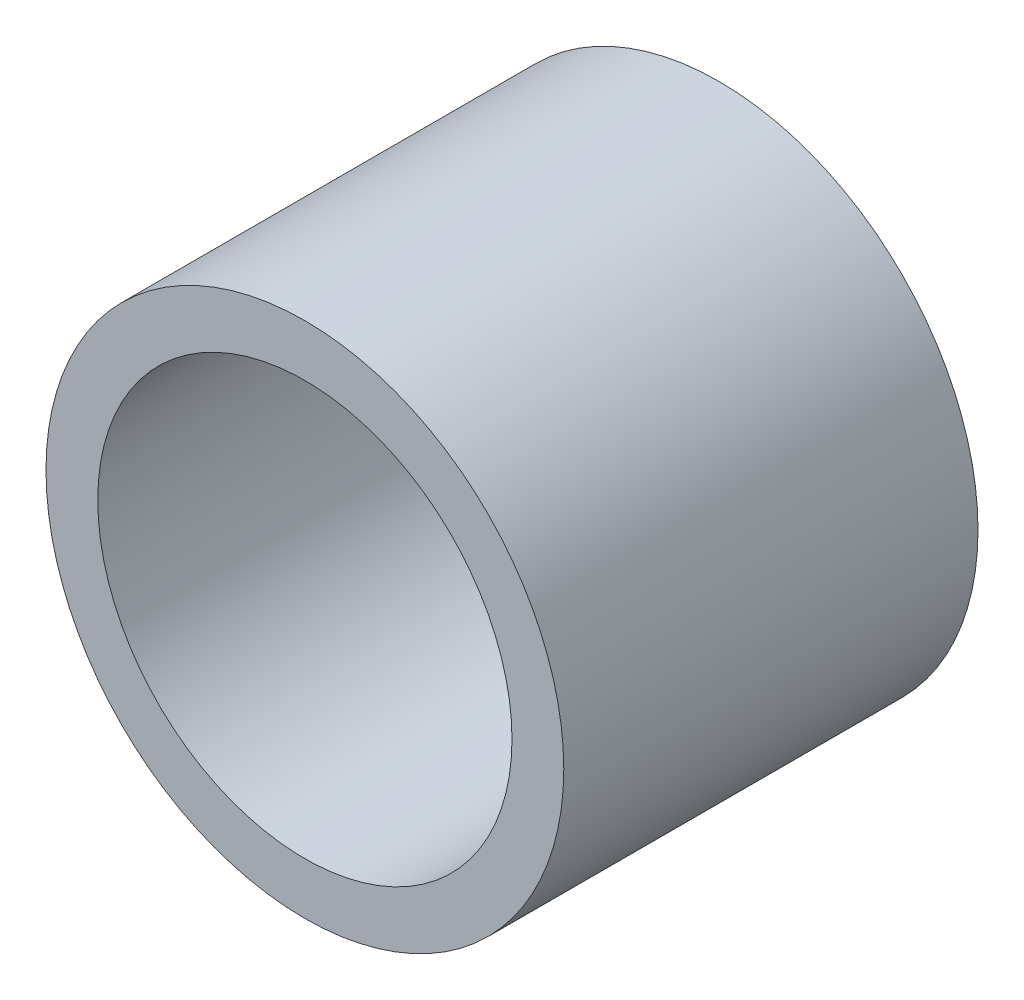
ISO-10303-21;
HEADER;
FILE_DESCRIPTION(('STEP AP214'),'2;1');
FILE_NAME('part.step','',(''),(''),'','','');
FILE_SCHEMA(('AUTOMOTIVE_DESIGN { 1 0 10303 214 1 1 1 1 }'));
ENDSEC;
DATA;
#1=APPLICATION_CONTEXT('core data for automotive mechanical design processes');
#2=APPLICATION_PROTOCOL_DEFINITION('international standard','automotive_design',2000,#1);
#3=PRODUCT_CONTEXT('',#1,'mechanical');
#4=PRODUCT('Part','Part','',(#3));
#5=PRODUCT_RELATED_PRODUCT_CATEGORY('part','',(#4));
#6=PRODUCT_DEFINITION_FORMATION('','',#4);
#7=PRODUCT_DEFINITION_CONTEXT('part definition',#1,'design');
#8=PRODUCT_DEFINITION('design','',#6,#7);
#9=PRODUCT_DEFINITION_SHAPE('','',#8);
#10=(LENGTH_UNIT() NAMED_UNIT(*) SI_UNIT(.MILLI.,.METRE.));
#11=(NAMED_UNIT(*) PLANE_ANGLE_UNIT() SI_UNIT($,.RADIAN.));
#12=(NAMED_UNIT(*) SI_UNIT($,.STERADIAN.) SOLID_ANGLE_UNIT());
#13=UNCERTAINTY_MEASURE_WITH_UNIT(LENGTH_MEASURE(1.E-05),#10,'distance_accuracy_value','');
#14=(GEOMETRIC_REPRESENTATION_CONTEXT(3) GLOBAL_UNCERTAINTY_ASSIGNED_CONTEXT((#13)) GLOBAL_UNIT_ASSIGNED_CONTEXT((#10,
#11,#12)) REPRESENTATION_CONTEXT('',''));
#15=CARTESIAN_POINT('',(0.,0.,0.));
#16=DIRECTION('',(0.,0.,1.));
#17=DIRECTION('',(1.,0.,0.));
#18=AXIS2_PLACEMENT_3D('',#15,#16,#17);
#19=CARTESIAN_POINT('',(0.,0.,3.175));
#20=DIRECTION('',(0.,0.,-1.));
#21=DIRECTION('',(-1.,0.,0.));
#22=AXIS2_PLACEMENT_3D('',#19,#20,#21);
#23=CYLINDRICAL_SURFACE('',#22,3.175);
#24=CARTESIAN_POINT('',(0.,0.,-3.175));
#25=DIRECTION('',(0.,0.,-1.));
#26=DIRECTION('',(-1.,0.,0.));
#27=AXIS2_PLACEMENT_3D('',#24,#25,#26);
#28=CIRCLE('',#27,3.175);
#29=CARTESIAN_POINT('',(-3.175,0.,-3.175));
#30=VERTEX_POINT('',#29);
#31=EDGE_CURVE('E10',#30,#30,#28,.T.);
#32=ORIENTED_EDGE('',*,*,#31,.T.);
#33=EDGE_LOOP('',(#32));
#34=FACE_BOUND('',#33,.T.);
#35=CARTESIAN_POINT('',(0.,0.,3.175));
#36=DIRECTION('',(0.,0.,-1.));
#37=DIRECTION('',(-1.,0.,0.));
#38=AXIS2_PLACEMENT_3D('',#35,#36,#37);
#39=CIRCLE('',#38,3.175);
#40=CARTESIAN_POINT('',(-3.175,0.,3.175));
#41=VERTEX_POINT('',#40);
#42=EDGE_CURVE('E45',#41,#41,#39,.T.);
#43=ORIENTED_EDGE('',*,*,#42,.F.);
#44=EDGE_LOOP('',(#43));
#45=FACE_BOUND('',#44,.T.);
#46=ADVANCED_FACE('F31',(#34,#45),#23,.F.);
#47=CARTESIAN_POINT('',(3.175,0.,-3.175));
#48=DIRECTION('',(0.,0.,-1.));
#49=DIRECTION('',(-1.,0.,0.));
#50=AXIS2_PLACEMENT_3D('',#47,#48,#49);
#51=PLANE('',#50);
#52=CARTESIAN_POINT('',(0.,0.,-3.175));
#53=DIRECTION('',(0.,0.,-1.));
#54=DIRECTION('',(-1.,0.,0.));
#55=AXIS2_PLACEMENT_3D('',#52,#53,#54);
#56=CIRCLE('',#55,3.96875);
#57=CARTESIAN_POINT('',(-3.96875,0.,-3.175));
#58=VERTEX_POINT('',#57);
#59=EDGE_CURVE('E37',#58,#58,#56,.T.);
#60=ORIENTED_EDGE('',*,*,#59,.T.);
#61=EDGE_LOOP('',(#60));
#62=FACE_BOUND('',#61,.T.);
#63=ORIENTED_EDGE('',*,*,#31,.F.);
#64=EDGE_LOOP('',(#63));
#65=FACE_BOUND('',#64,.T.);
#66=ADVANCED_FACE('F55',(#62,#65),#51,.T.);
#67=CARTESIAN_POINT('',(0.,0.,3.175));
#68=DIRECTION('',(0.,0.,-1.));
#69=DIRECTION('',(-1.,0.,0.));
#70=AXIS2_PLACEMENT_3D('',#67,#68,#69);
#71=CYLINDRICAL_SURFACE('',#70,3.96875);
#72=CARTESIAN_POINT('',(0.,0.,3.175));
#73=DIRECTION('',(0.,0.,-1.));
#74=DIRECTION('',(-1.,0.,0.));
#75=AXIS2_PLACEMENT_3D('',#72,#73,#74);
#76=CIRCLE('',#75,3.96875);
#77=CARTESIAN_POINT('',(-3.96875,0.,3.175));
#78=VERTEX_POINT('',#77);
#79=EDGE_CURVE('E41',#78,#78,#76,.T.);
#80=ORIENTED_EDGE('',*,*,#79,.T.);
#81=EDGE_LOOP('',(#80));
#82=FACE_BOUND('',#81,.T.);
#83=ORIENTED_EDGE('',*,*,#59,.F.);
#84=EDGE_LOOP('',(#83));
#85=FACE_BOUND('',#84,.T.);
#86=ADVANCED_FACE('F59',(#82,#85),#71,.T.);
#87=CARTESIAN_POINT('',(3.96875,0.,3.175));
#88=DIRECTION('',(0.,0.,1.));
#89=DIRECTION('',(1.,0.,0.));
#90=AXIS2_PLACEMENT_3D('',#87,#88,#89);
#91=PLANE('',#90);
#92=ORIENTED_EDGE('',*,*,#42,.T.);
#93=EDGE_LOOP('',(#92));
#94=FACE_BOUND('',#93,.T.);
#95=ORIENTED_EDGE('',*,*,#79,.F.);
#96=EDGE_LOOP('',(#95));
#97=FACE_BOUND('',#96,.T.);
#98=ADVANCED_FACE('F51',(#94,#97),#91,.T.);
#99=CLOSED_SHELL('',(#46,#66,#86,#98));
#100=MANIFOLD_SOLID_BREP('B2',#99);
#101=ADVANCED_BREP_SHAPE_REPRESENTATION('',(#18,#100),#14);
#102=SHAPE_DEFINITION_REPRESENTATION(#9,#101);
ENDSEC;
END-ISO-10303-21;
